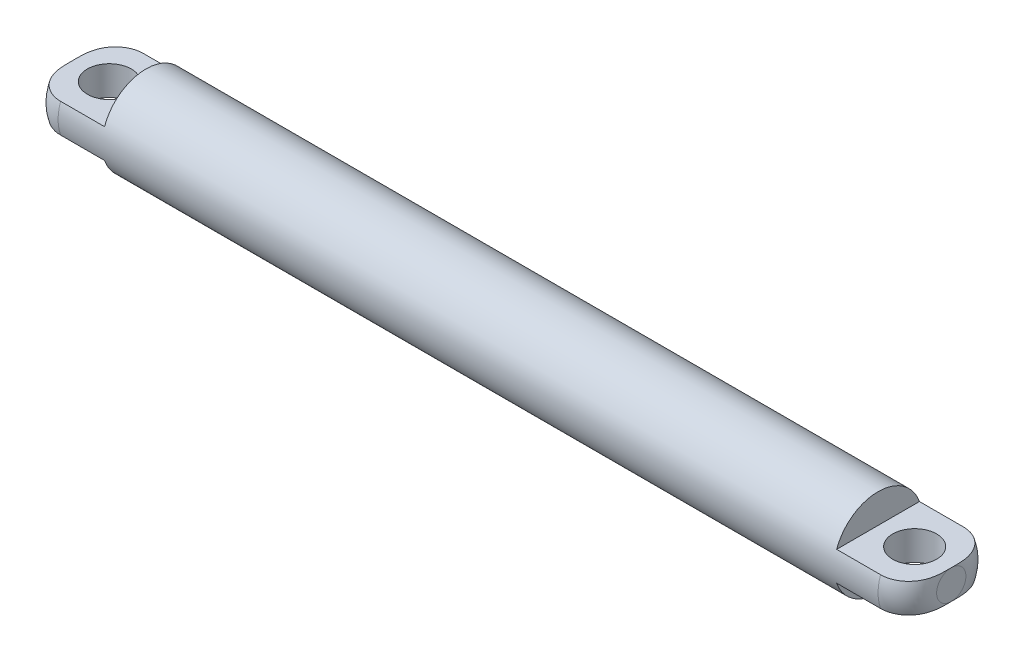
ISO-10303-21;
HEADER;
FILE_DESCRIPTION(('STEP AP214'),'2;1');
FILE_NAME('part.step','',(''),(''),'','','');
FILE_SCHEMA(('AUTOMOTIVE_DESIGN { 1 0 10303 214 1 1 1 1 }'));
ENDSEC;
DATA;
#1=APPLICATION_CONTEXT('core data for automotive mechanical design processes');
#2=APPLICATION_PROTOCOL_DEFINITION('international standard','automotive_design',2000,#1);
#3=PRODUCT_CONTEXT('',#1,'mechanical');
#4=PRODUCT('Part','Part','',(#3));
#5=PRODUCT_RELATED_PRODUCT_CATEGORY('part','',(#4));
#6=PRODUCT_DEFINITION_FORMATION('','',#4);
#7=PRODUCT_DEFINITION_CONTEXT('part definition',#1,'design');
#8=PRODUCT_DEFINITION('design','',#6,#7);
#9=PRODUCT_DEFINITION_SHAPE('','',#8);
#10=(LENGTH_UNIT() NAMED_UNIT(*) SI_UNIT(.MILLI.,.METRE.));
#11=(NAMED_UNIT(*) PLANE_ANGLE_UNIT() SI_UNIT($,.RADIAN.));
#12=(NAMED_UNIT(*) SI_UNIT($,.STERADIAN.) SOLID_ANGLE_UNIT());
#13=UNCERTAINTY_MEASURE_WITH_UNIT(LENGTH_MEASURE(1.E-05),#10,'distance_accuracy_value','');
#14=(GEOMETRIC_REPRESENTATION_CONTEXT(3) GLOBAL_UNCERTAINTY_ASSIGNED_CONTEXT((#13)) GLOBAL_UNIT_ASSIGNED_CONTEXT((#10,
#11,#12)) REPRESENTATION_CONTEXT('',''));
#15=CARTESIAN_POINT('',(0.,0.,0.));
#16=DIRECTION('',(0.,0.,1.));
#17=DIRECTION('',(1.,0.,0.));
#18=AXIS2_PLACEMENT_3D('',#15,#16,#17);
#19=CARTESIAN_POINT('',(30.,0.,0.));
#20=DIRECTION('',(-1.,0.,0.));
#21=DIRECTION('',(0.,0.,1.));
#22=AXIS2_PLACEMENT_3D('',#19,#20,#21);
#23=CYLINDRICAL_SURFACE('',#22,3.);
#24=DIRECTION('',(-1.,0.,0.));
#25=VECTOR('',#24,1.);
#26=CARTESIAN_POINT('',(30.,1.,-2.82842712474619));
#27=LINE('',#26,#25);
#28=CARTESIAN_POINT('',(28.,1.,-2.82842712474619));
#29=VERTEX_POINT('',#28);
#30=CARTESIAN_POINT('',(25.,1.,-2.82842712474619));
#31=VERTEX_POINT('',#30);
#32=EDGE_CURVE('E194',#29,#31,#27,.T.);
#33=ORIENTED_EDGE('',*,*,#32,.F.);
#34=CARTESIAN_POINT('',(28.,0.,0.));
#35=DIRECTION('',(-1.,0.,0.));
#36=DIRECTION('',(0.,-1.,0.));
#37=AXIS2_PLACEMENT_3D('',#34,#35,#36);
#38=CIRCLE('',#37,3.);
#39=CARTESIAN_POINT('',(28.,-1.,-2.82842712474619));
#40=VERTEX_POINT('',#39);
#41=EDGE_CURVE('E237',#29,#40,#38,.T.);
#42=ORIENTED_EDGE('',*,*,#41,.T.);
#43=DIRECTION('',(-1.,0.,0.));
#44=VECTOR('',#43,1.);
#45=CARTESIAN_POINT('',(30.,-1.,-2.82842712474619));
#46=LINE('',#45,#44);
#47=CARTESIAN_POINT('',(25.,-1.,-2.82842712474619));
#48=VERTEX_POINT('',#47);
#49=EDGE_CURVE('E188',#40,#48,#46,.T.);
#50=ORIENTED_EDGE('',*,*,#49,.T.);
#51=CARTESIAN_POINT('',(25.,0.,0.));
#52=DIRECTION('',(1.,0.,0.));
#53=DIRECTION('',(0.,1.,0.));
#54=AXIS2_PLACEMENT_3D('',#51,#52,#53);
#55=CIRCLE('',#54,3.);
#56=CARTESIAN_POINT('',(25.,-1.,2.82842712474619));
#57=VERTEX_POINT('',#56);
#58=EDGE_CURVE('E201',#48,#57,#55,.F.);
#59=ORIENTED_EDGE('',*,*,#58,.T.);
#60=DIRECTION('',(-1.,0.,0.));
#61=VECTOR('',#60,1.);
#62=CARTESIAN_POINT('',(30.,-1.,2.82842712474619));
#63=LINE('',#62,#61);
#64=CARTESIAN_POINT('',(28.,-1.,2.82842712474619));
#65=VERTEX_POINT('',#64);
#66=EDGE_CURVE('E187',#65,#57,#63,.T.);
#67=ORIENTED_EDGE('',*,*,#66,.F.);
#68=CARTESIAN_POINT('',(28.,0.,0.));
#69=DIRECTION('',(-1.,0.,0.));
#70=DIRECTION('',(0.,-1.,0.));
#71=AXIS2_PLACEMENT_3D('',#68,#69,#70);
#72=CIRCLE('',#71,3.);
#73=CARTESIAN_POINT('',(28.,1.,2.82842712474619));
#74=VERTEX_POINT('',#73);
#75=EDGE_CURVE('E204',#65,#74,#72,.T.);
#76=ORIENTED_EDGE('',*,*,#75,.T.);
#77=DIRECTION('',(-1.,0.,0.));
#78=VECTOR('',#77,1.);
#79=CARTESIAN_POINT('',(30.,1.,2.82842712474619));
#80=LINE('',#79,#78);
#81=CARTESIAN_POINT('',(25.,1.,2.82842712474619));
#82=VERTEX_POINT('',#81);
#83=EDGE_CURVE('E195',#74,#82,#80,.T.);
#84=ORIENTED_EDGE('',*,*,#83,.T.);
#85=CARTESIAN_POINT('',(25.,0.,0.));
#86=DIRECTION('',(1.,0.,0.));
#87=DIRECTION('',(0.,1.,0.));
#88=AXIS2_PLACEMENT_3D('',#85,#86,#87);
#89=CIRCLE('',#88,3.);
#90=EDGE_CURVE('E197',#82,#31,#89,.F.);
#91=ORIENTED_EDGE('',*,*,#90,.T.);
#92=EDGE_LOOP('',(#33,#42,#50,#59,#67,#76,#84,#91));
#93=FACE_BOUND('',#92,.T.);
#94=DIRECTION('',(-1.,0.,0.));
#95=VECTOR('',#94,1.);
#96=CARTESIAN_POINT('',(30.,-1.,-2.82842712474619));
#97=LINE('',#96,#95);
#98=CARTESIAN_POINT('',(-28.,-1.,-2.82842712474619));
#99=VERTEX_POINT('',#98);
#100=CARTESIAN_POINT('',(-25.,-1.,-2.82842712474619));
#101=VERTEX_POINT('',#100);
#102=EDGE_CURVE('E93',#99,#101,#97,.F.);
#103=ORIENTED_EDGE('',*,*,#102,.F.);
#104=CARTESIAN_POINT('',(-28.,0.,0.));
#105=DIRECTION('',(-1.,0.,0.));
#106=DIRECTION('',(0.,-1.,0.));
#107=AXIS2_PLACEMENT_3D('',#104,#105,#106);
#108=CIRCLE('',#107,3.);
#109=CARTESIAN_POINT('',(-28.,1.,-2.82842712474619));
#110=VERTEX_POINT('',#109);
#111=EDGE_CURVE('E28',#99,#110,#108,.F.);
#112=ORIENTED_EDGE('',*,*,#111,.T.);
#113=DIRECTION('',(-1.,0.,0.));
#114=VECTOR('',#113,1.);
#115=CARTESIAN_POINT('',(30.,1.,-2.82842712474619));
#116=LINE('',#115,#114);
#117=CARTESIAN_POINT('',(-25.,1.,-2.82842712474619));
#118=VERTEX_POINT('',#117);
#119=EDGE_CURVE('E171',#110,#118,#116,.F.);
#120=ORIENTED_EDGE('',*,*,#119,.T.);
#121=CARTESIAN_POINT('',(-25.,0.,0.));
#122=DIRECTION('',(-1.,0.,0.));
#123=DIRECTION('',(0.,-1.,0.));
#124=AXIS2_PLACEMENT_3D('',#121,#122,#123);
#125=CIRCLE('',#124,3.);
#126=CARTESIAN_POINT('',(-25.,1.,2.82842712474619));
#127=VERTEX_POINT('',#126);
#128=EDGE_CURVE('E108',#118,#127,#125,.F.);
#129=ORIENTED_EDGE('',*,*,#128,.T.);
#130=DIRECTION('',(-1.,0.,0.));
#131=VECTOR('',#130,1.);
#132=CARTESIAN_POINT('',(30.,1.,2.82842712474619));
#133=LINE('',#132,#131);
#134=CARTESIAN_POINT('',(-28.,1.,2.82842712474619));
#135=VERTEX_POINT('',#134);
#136=EDGE_CURVE('E168',#135,#127,#133,.F.);
#137=ORIENTED_EDGE('',*,*,#136,.F.);
#138=CARTESIAN_POINT('',(-28.,0.,0.));
#139=DIRECTION('',(-1.,0.,0.));
#140=DIRECTION('',(0.,-1.,0.));
#141=AXIS2_PLACEMENT_3D('',#138,#139,#140);
#142=CIRCLE('',#141,3.);
#143=CARTESIAN_POINT('',(-28.,-1.,2.82842712474619));
#144=VERTEX_POINT('',#143);
#145=EDGE_CURVE('E123',#135,#144,#142,.F.);
#146=ORIENTED_EDGE('',*,*,#145,.T.);
#147=DIRECTION('',(-1.,0.,0.));
#148=VECTOR('',#147,1.);
#149=CARTESIAN_POINT('',(30.,-1.,2.82842712474619));
#150=LINE('',#149,#148);
#151=CARTESIAN_POINT('',(-25.,-1.,2.82842712474619));
#152=VERTEX_POINT('',#151);
#153=EDGE_CURVE('E100',#144,#152,#150,.F.);
#154=ORIENTED_EDGE('',*,*,#153,.T.);
#155=CARTESIAN_POINT('',(-25.,0.,0.));
#156=DIRECTION('',(-1.,0.,0.));
#157=DIRECTION('',(0.,-1.,0.));
#158=AXIS2_PLACEMENT_3D('',#155,#156,#157);
#159=CIRCLE('',#158,3.);
#160=EDGE_CURVE('E104',#152,#101,#159,.F.);
#161=ORIENTED_EDGE('',*,*,#160,.T.);
#162=EDGE_LOOP('',(#103,#112,#120,#129,#137,#146,#154,#161));
#163=FACE_BOUND('',#162,.T.);
#164=ADVANCED_FACE('F16',(#93,#163),#23,.T.);
#165=CARTESIAN_POINT('',(-30.,0.,0.));
#166=DIRECTION('',(-1.,0.,0.));
#167=DIRECTION('',(0.,-1.,0.));
#168=AXIS2_PLACEMENT_3D('',#165,#166,#167);
#169=PLANE('',#168);
#170=CARTESIAN_POINT('',(-30.,0.,0.));
#171=DIRECTION('',(-1.,0.,0.));
#172=DIRECTION('',(0.,-1.,0.));
#173=AXIS2_PLACEMENT_3D('',#170,#171,#172);
#174=CIRCLE('',#173,1.);
#175=CARTESIAN_POINT('',(-30.,-1.,0.));
#176=VERTEX_POINT('',#175);
#177=CARTESIAN_POINT('',(-30.,1.,0.));
#178=VERTEX_POINT('',#177);
#179=EDGE_CURVE('E107',#176,#178,#174,.T.);
#180=ORIENTED_EDGE('',*,*,#179,.T.);
#181=CARTESIAN_POINT('',(-30.,0.,0.));
#182=DIRECTION('',(-1.,0.,0.));
#183=DIRECTION('',(0.,-1.,0.));
#184=AXIS2_PLACEMENT_3D('',#181,#182,#183);
#185=CIRCLE('',#184,1.);
#186=EDGE_CURVE('E145',#178,#176,#185,.T.);
#187=ORIENTED_EDGE('',*,*,#186,.T.);
#188=EDGE_LOOP('',(#180,#187));
#189=FACE_BOUND('',#188,.T.);
#190=ADVANCED_FACE('F158',(#189),#169,.T.);
#191=CARTESIAN_POINT('',(30.,0.,0.));
#192=DIRECTION('',(-1.,0.,0.));
#193=DIRECTION('',(0.,-1.,0.));
#194=AXIS2_PLACEMENT_3D('',#191,#192,#193);
#195=PLANE('',#194);
#196=CARTESIAN_POINT('',(30.,0.,0.));
#197=DIRECTION('',(-1.,0.,0.));
#198=DIRECTION('',(0.,-1.,0.));
#199=AXIS2_PLACEMENT_3D('',#196,#197,#198);
#200=CIRCLE('',#199,1.);
#201=CARTESIAN_POINT('',(30.,1.,0.));
#202=VERTEX_POINT('',#201);
#203=CARTESIAN_POINT('',(30.,-1.,0.));
#204=VERTEX_POINT('',#203);
#205=EDGE_CURVE('E215',#202,#204,#200,.F.);
#206=ORIENTED_EDGE('',*,*,#205,.T.);
#207=CARTESIAN_POINT('',(30.,0.,0.));
#208=DIRECTION('',(-1.,0.,0.));
#209=DIRECTION('',(0.,-1.,0.));
#210=AXIS2_PLACEMENT_3D('',#207,#208,#209);
#211=CIRCLE('',#210,1.);
#212=EDGE_CURVE('E251',#204,#202,#211,.F.);
#213=ORIENTED_EDGE('',*,*,#212,.T.);
#214=EDGE_LOOP('',(#206,#213));
#215=FACE_BOUND('',#214,.T.);
#216=ADVANCED_FACE('F273',(#215),#195,.F.);
#217=CARTESIAN_POINT('',(25.,1.,0.0674042553191455));
#218=DIRECTION('',(1.,0.,0.));
#219=DIRECTION('',(0.,1.,0.));
#220=AXIS2_PLACEMENT_3D('',#217,#218,#219);
#221=PLANE('',#220);
#222=DIRECTION('',(0.,0.,1.));
#223=VECTOR('',#222,1.);
#224=CARTESIAN_POINT('',(25.,1.,1.94246808510638));
#225=LINE('',#224,#223);
#226=EDGE_CURVE('E190',#31,#82,#225,.T.);
#227=ORIENTED_EDGE('',*,*,#226,.F.);
#228=ORIENTED_EDGE('',*,*,#90,.F.);
#229=EDGE_LOOP('',(#227,#228));
#230=FACE_BOUND('',#229,.T.);
#231=ADVANCED_FACE('F244',(#230),#221,.T.);
#232=CARTESIAN_POINT('',(25.,1.,1.94246808510638));
#233=DIRECTION('',(0.,1.,0.));
#234=DIRECTION('',(0.,0.,1.));
#235=AXIS2_PLACEMENT_3D('',#232,#233,#234);
#236=PLANE('',#235);
#237=CARTESIAN_POINT('',(27.5,1.,0.));
#238=DIRECTION('',(0.,1.,0.));
#239=DIRECTION('',(0.,0.,1.));
#240=AXIS2_PLACEMENT_3D('',#237,#238,#239);
#241=CIRCLE('',#240,1.5);
#242=CARTESIAN_POINT('',(27.5,1.,1.49999999999999));
#243=VERTEX_POINT('',#242);
#244=EDGE_CURVE('E181',#243,#243,#241,.T.);
#245=ORIENTED_EDGE('',*,*,#244,.F.);
#246=EDGE_LOOP('',(#245));
#247=FACE_BOUND('',#246,.T.);
#248=CARTESIAN_POINT('',(28.,1.,2.82842712474619));
#249=CARTESIAN_POINT('',(28.0534134185692,1.,2.82842727874098));
#250=CARTESIAN_POINT('',(28.1068009403029,1.,2.82615609057115));
#251=CARTESIAN_POINT('',(28.2131868748628,1.,2.81709913374379));
#252=CARTESIAN_POINT('',(28.2661853218281,1.,2.81031376608332));
#253=CARTESIAN_POINT('',(28.4237977959824,1.,2.78328069856728));
#254=CARTESIAN_POINT('',(28.527344962754,1.,2.75635563239891));
#255=CARTESIAN_POINT('',(28.7284247791076,1.,2.68552958072627));
#256=CARTESIAN_POINT('',(28.8259557756697,1.,2.6416239534729));
#257=CARTESIAN_POINT('',(29.0124262918775,1.,2.53818346737532));
#258=CARTESIAN_POINT('',(29.101360576554,1.,2.47863916636453));
#259=CARTESIAN_POINT('',(29.269129685692,1.,2.34510033639576));
#260=CARTESIAN_POINT('',(29.3478480525676,1.,2.27095997430665));
#261=CARTESIAN_POINT('',(29.4921296879379,1.,2.11103080172936));
#262=CARTESIAN_POINT('',(29.5577145845687,1.,2.02526153896786));
#263=CARTESIAN_POINT('',(29.6464926226104,1.,1.88819156070421));
#264=CARTESIAN_POINT('',(29.6748947452371,1.,1.84017291757007));
#265=CARTESIAN_POINT('',(29.727844841987,1.,1.74203010949198));
#266=CARTESIAN_POINT('',(29.7523919490601,1.,1.6919054740833));
#267=CARTESIAN_POINT('',(29.7977270069453,1.,1.58965856670973));
#268=CARTESIAN_POINT('',(29.8184932829791,1.,1.53752673205066));
#269=CARTESIAN_POINT('',(29.856156437881,1.,1.43192521666244));
#270=CARTESIAN_POINT('',(29.8730557370771,1.,1.37845639612616));
#271=CARTESIAN_POINT('',(29.9031414210198,1.,1.2705444246326));
#272=CARTESIAN_POINT('',(29.9163312285144,1.,1.21610222148526));
#273=CARTESIAN_POINT('',(29.9392740125722,1.,1.1064964336901));
#274=CARTESIAN_POINT('',(29.9490264116991,1.,1.05133272945287));
#275=CARTESIAN_POINT('',(29.9654864587239,1.,0.940347532108662));
#276=CARTESIAN_POINT('',(29.9721824192731,1.,0.88452433777076));
#277=CARTESIAN_POINT('',(29.9829638435405,1.,0.772638286801442));
#278=CARTESIAN_POINT('',(29.9870494473972,1.,0.716575443198437));
#279=CARTESIAN_POINT('',(29.9931672218253,1.,0.605248250162798));
#280=CARTESIAN_POINT('',(29.9952312996767,1.,0.549985527940671));
#281=CARTESIAN_POINT('',(29.9980725912754,1.,0.439425669261678));
#282=CARTESIAN_POINT('',(29.998849654657,1.,0.384128529538606));
#283=CARTESIAN_POINT('',(29.9997586713635,1.,0.274015164487416));
#284=CARTESIAN_POINT('',(29.9998962108802,1.,0.219198965595557));
#285=CARTESIAN_POINT('',(29.9999843379834,1.,0.136985611032237));
#286=CARTESIAN_POINT('',(29.999994026409,1.,0.109588396353902));
#287=CARTESIAN_POINT('',(30.000000288343,1.,0.0547941288638778));
#288=CARTESIAN_POINT('',(29.9999968619305,1.,0.0273970760522091));
#289=CARTESIAN_POINT('',(30.,1.,0.));
#290=B_SPLINE_CURVE_WITH_KNOTS('',3,(#248,#249,#250,#251,#252,#253,#254,#255,#256,#257,#258,
#259,#260,#261,#262,#263,#264,#265,#266,#267,#268,#269,#270,#271,#272,#273,#274,#275,#276,#277,
#278,#279,#280,#281,#282,#283,#284,#285,#286,#287,#288,#289),.UNSPECIFIED.,.F.,.F.,(4,2,2,2,2,2,
2,2,2,2,2,2,2,2,2,2,2,2,2,2,4),(0.,0.160140695968357,0.320267168449515,0.639584298722542,
0.958988778218193,1.27858654975606,1.60155633590395,1.92398980210736,2.09121351018164,
2.25847477564547,2.42666663721379,2.59475293834405,2.76268363356718,2.93064252535585,
3.09923839372392,3.2678252101614,3.43370602073401,3.59960621028102,3.7640545176238,
3.84624619393037,3.92843737385875),.UNSPECIFIED.);
#291=EDGE_CURVE('E207',#74,#202,#290,.T.);
#292=ORIENTED_EDGE('',*,*,#291,.T.);
#293=CARTESIAN_POINT('',(30.,1.,0.));
#294=CARTESIAN_POINT('',(29.9999811059462,1.,-0.0413051048091001));
#295=CARTESIAN_POINT('',(29.9999998714518,1.,-0.0826101738747882));
#296=CARTESIAN_POINT('',(29.999970879717,1.,-0.165222874211095));
#297=CARTESIAN_POINT('',(29.9999231182512,1.,-0.206530505477812));
#298=CARTESIAN_POINT('',(29.9996187489818,1.,-0.289267520785349));
#299=CARTESIAN_POINT('',(29.9993615257663,1.,-0.330696904674477));
#300=CARTESIAN_POINT('',(29.9983937565273,1.,-0.413550023625729));
#301=CARTESIAN_POINT('',(29.9976832090222,1.,-0.454973758668949));
#302=CARTESIAN_POINT('',(29.9944217496167,1.,-0.580658224593739));
#303=CARTESIAN_POINT('',(29.9907273831892,1.,-0.664900399595359));
#304=CARTESIAN_POINT('',(29.9780630817101,1.,-0.832932913292913));
#305=CARTESIAN_POINT('',(29.9690996333136,1.,-0.916723679932438));
#306=CARTESIAN_POINT('',(29.9468537643812,1.,-1.0653686350169));
#307=CARTESIAN_POINT('',(29.9349145798215,1.,-1.13042028696978));
#308=CARTESIAN_POINT('',(29.9061544146505,1.,-1.25945468255724));
#309=CARTESIAN_POINT('',(29.8893331953076,1.,-1.32343737375775));
#310=CARTESIAN_POINT('',(29.8505559373908,1.,-1.44942432107065));
#311=CARTESIAN_POINT('',(29.8286308943741,1.,-1.5114380489648));
#312=CARTESIAN_POINT('',(29.7794065494532,1.,-1.63332416258286));
#313=CARTESIAN_POINT('',(29.7521057812227,1.,-1.69319595877904));
#314=CARTESIAN_POINT('',(29.6917865874517,1.,-1.81080379539798));
#315=CARTESIAN_POINT('',(29.6587103394204,1.,-1.86851028196906));
#316=CARTESIAN_POINT('',(29.5871423138564,1.,-1.98050228012009));
#317=CARTESIAN_POINT('',(29.5486481746661,1.,-2.03478628481942));
#318=CARTESIAN_POINT('',(29.4664252187279,1.,-2.1393694448159));
#319=CARTESIAN_POINT('',(29.4226891789614,1.,-2.18966293919676));
#320=CARTESIAN_POINT('',(29.3303755276852,1.,-2.28559869601453));
#321=CARTESIAN_POINT('',(29.2817963433002,1.,-2.33123943761173));
#322=CARTESIAN_POINT('',(29.1438136001072,1.,-2.44814359903828));
#323=CARTESIAN_POINT('',(29.0500585975621,1.,-2.51439026871331));
#324=CARTESIAN_POINT('',(28.8524171570711,1.,-2.62905300420049));
#325=CARTESIAN_POINT('',(28.7485429807124,1.,-2.67749031820066));
#326=CARTESIAN_POINT('',(28.5386737135734,1.,-2.75316508721767));
#327=CARTESIAN_POINT('',(28.4329964558135,1.,-2.78127592056807));
#328=CARTESIAN_POINT('',(28.2720297631954,1.,-2.8095059630724));
#329=CARTESIAN_POINT('',(28.21788020628,1.,-2.81659339327167));
#330=CARTESIAN_POINT('',(28.1091628574479,1.,-2.82605444066287));
#331=CARTESIAN_POINT('',(28.0545950055283,1.,-2.82842736837363));
#332=CARTESIAN_POINT('',(28.,1.,-2.82842712474619));
#333=B_SPLINE_CURVE_WITH_KNOTS('',3,(#293,#294,#295,#296,#297,#298,#299,#300,#301,#302,#303,
#304,#305,#306,#307,#308,#309,#310,#311,#312,#313,#314,#315,#316,#317,#318,#319,#320,#321,#322,
#323,#324,#325,#326,#327,#328,#329,#330,#331,#332),.UNSPECIFIED.,.F.,.F.,(4,2,2,2,2,2,2,2,2,2,2,
2,2,2,2,2,2,2,2,4),(0.,0.123915213091161,0.247838297076798,0.372126794276857,0.496415697669469,
0.749287706863618,1.00184906071816,1.2000997872884,1.39836020995646,1.59544663712704,
1.79258689784029,1.99182769885301,2.19115561942924,2.39076142961193,2.59043227690346,
2.93288931892069,3.27493644229983,3.60123554224765,3.76489133262651,3.92857105538905),.UNSPECIFIED.);
#334=EDGE_CURVE('E114',#202,#29,#333,.T.);
#335=ORIENTED_EDGE('',*,*,#334,.T.);
#336=ORIENTED_EDGE('',*,*,#32,.T.);
#337=ORIENTED_EDGE('',*,*,#226,.T.);
#338=ORIENTED_EDGE('',*,*,#83,.F.);
#339=EDGE_LOOP('',(#292,#335,#336,#337,#338));
#340=FACE_BOUND('',#339,.T.);
#341=ADVANCED_FACE('F217',(#247,#340),#236,.T.);
#342=CARTESIAN_POINT('',(25.,-1.,0.0674042553191455));
#343=DIRECTION('',(1.,0.,0.));
#344=DIRECTION('',(0.,1.,0.));
#345=AXIS2_PLACEMENT_3D('',#342,#343,#344);
#346=PLANE('',#345);
#347=DIRECTION('',(0.,0.,-1.));
#348=VECTOR('',#347,1.);
#349=CARTESIAN_POINT('',(25.,-1.,-1.80765957446809));
#350=LINE('',#349,#348);
#351=EDGE_CURVE('E184',#57,#48,#350,.T.);
#352=ORIENTED_EDGE('',*,*,#351,.F.);
#353=ORIENTED_EDGE('',*,*,#58,.F.);
#354=EDGE_LOOP('',(#352,#353));
#355=FACE_BOUND('',#354,.T.);
#356=ADVANCED_FACE('F242',(#355),#346,.T.);
#357=CARTESIAN_POINT('',(25.,-1.,-1.80765957446809));
#358=DIRECTION('',(0.,-1.,0.));
#359=DIRECTION('',(0.,0.,-1.));
#360=AXIS2_PLACEMENT_3D('',#357,#358,#359);
#361=PLANE('',#360);
#362=CARTESIAN_POINT('',(27.5,-1.,0.));
#363=DIRECTION('',(0.,1.,0.));
#364=DIRECTION('',(0.,0.,-1.));
#365=AXIS2_PLACEMENT_3D('',#362,#363,#364);
#366=CIRCLE('',#365,1.5);
#367=CARTESIAN_POINT('',(27.5,-1.,-1.50000000000001));
#368=VERTEX_POINT('',#367);
#369=EDGE_CURVE('E174',#368,#368,#366,.T.);
#370=ORIENTED_EDGE('',*,*,#369,.T.);
#371=EDGE_LOOP('',(#370));
#372=FACE_BOUND('',#371,.T.);
#373=ORIENTED_EDGE('',*,*,#49,.F.);
#374=CARTESIAN_POINT('',(28.,-1.,-2.82842712474619));
#375=CARTESIAN_POINT('',(28.0534134185692,-1.,-2.82842727874098));
#376=CARTESIAN_POINT('',(28.1068009403029,-1.,-2.82615609057115));
#377=CARTESIAN_POINT('',(28.2131868748628,-1.,-2.8170991337438));
#378=CARTESIAN_POINT('',(28.2661853218281,-1.,-2.81031376608333));
#379=CARTESIAN_POINT('',(28.4237977959824,-1.,-2.78328069856728));
#380=CARTESIAN_POINT('',(28.527344962754,-1.,-2.75635563239892));
#381=CARTESIAN_POINT('',(28.7284247791076,-1.,-2.68552958072627));
#382=CARTESIAN_POINT('',(28.8259557756697,-1.,-2.6416239534729));
#383=CARTESIAN_POINT('',(29.0124262918775,-1.,-2.53818346737532));
#384=CARTESIAN_POINT('',(29.101360576554,-1.,-2.47863916636453));
#385=CARTESIAN_POINT('',(29.269129685692,-1.,-2.34510033639576));
#386=CARTESIAN_POINT('',(29.3478480525676,-1.,-2.27095997430665));
#387=CARTESIAN_POINT('',(29.4921296879379,-1.,-2.11103080172936));
#388=CARTESIAN_POINT('',(29.5577145845687,-1.,-2.02526153896786));
#389=CARTESIAN_POINT('',(29.6464926226104,-1.,-1.88819156070422));
#390=CARTESIAN_POINT('',(29.6748947452371,-1.,-1.84017291757007));
#391=CARTESIAN_POINT('',(29.727844841987,-1.,-1.74203010949199));
#392=CARTESIAN_POINT('',(29.7523919490601,-1.,-1.69190547408331));
#393=CARTESIAN_POINT('',(29.7977270069453,-1.,-1.58965856670973));
#394=CARTESIAN_POINT('',(29.8184932829791,-1.,-1.53752673205067));
#395=CARTESIAN_POINT('',(29.856156437881,-1.,-1.43192521666244));
#396=CARTESIAN_POINT('',(29.8730557370771,-1.,-1.37845639612616));
#397=CARTESIAN_POINT('',(29.9031414210198,-1.,-1.2705444246326));
#398=CARTESIAN_POINT('',(29.9163312285144,-1.,-1.21610222148526));
#399=CARTESIAN_POINT('',(29.9392740125722,-1.,-1.1064964336901));
#400=CARTESIAN_POINT('',(29.9490264116991,-1.,-1.05133272945288));
#401=CARTESIAN_POINT('',(29.9654864587239,-1.,-0.940347532108665));
#402=CARTESIAN_POINT('',(29.9721824192731,-1.,-0.884524337770764));
#403=CARTESIAN_POINT('',(29.9829638435405,-1.,-0.772638286801446));
#404=CARTESIAN_POINT('',(29.9870494473972,-1.,-0.716575443198441));
#405=CARTESIAN_POINT('',(29.9931672218253,-1.,-0.605248250162801));
#406=CARTESIAN_POINT('',(29.9952312996767,-1.,-0.549985527940674));
#407=CARTESIAN_POINT('',(29.9980725912754,-1.,-0.439425669261682));
#408=CARTESIAN_POINT('',(29.998849654657,-1.,-0.384128529538609));
#409=CARTESIAN_POINT('',(29.9997586713635,-1.,-0.274015164487419));
#410=CARTESIAN_POINT('',(29.9998962108802,-1.,-0.219198965595561));
#411=CARTESIAN_POINT('',(29.9999843379834,-1.,-0.13698561103224));
#412=CARTESIAN_POINT('',(29.999994026409,-1.,-0.109588396353906));
#413=CARTESIAN_POINT('',(30.000000288343,-1.,-0.0547941288638812));
#414=CARTESIAN_POINT('',(29.9999968619305,-1.,-0.0273970760522123));
#415=CARTESIAN_POINT('',(30.,-1.,0.));
#416=B_SPLINE_CURVE_WITH_KNOTS('',3,(#374,#375,#376,#377,#378,#379,#380,#381,#382,#383,#384,
#385,#386,#387,#388,#389,#390,#391,#392,#393,#394,#395,#396,#397,#398,#399,#400,#401,#402,#403,
#404,#405,#406,#407,#408,#409,#410,#411,#412,#413,#414,#415),.UNSPECIFIED.,.F.,.F.,(4,2,2,2,2,2,
2,2,2,2,2,2,2,2,2,2,2,2,2,2,4),(0.,0.160140695968357,0.320267168449515,0.639584298722542,
0.958988778218193,1.27858654975606,1.60155633590395,1.92398980210736,2.09121351018164,
2.25847477564547,2.42666663721378,2.59475293834405,2.76268363356718,2.93064252535585,
3.09923839372392,3.2678252101614,3.43370602073401,3.59960621028101,3.7640545176238,
3.84624619393037,3.92843737385875),.UNSPECIFIED.);
#417=EDGE_CURVE('E246',#40,#204,#416,.T.);
#418=ORIENTED_EDGE('',*,*,#417,.T.);
#419=CARTESIAN_POINT('',(30.,-1.,0.));
#420=CARTESIAN_POINT('',(29.9999811059462,-1.,0.0413051048090971));
#421=CARTESIAN_POINT('',(29.9999998714518,-1.,0.0826101738747852));
#422=CARTESIAN_POINT('',(29.999970879717,-1.,0.165222874211092));
#423=CARTESIAN_POINT('',(29.9999231182512,-1.,0.206530505477809));
#424=CARTESIAN_POINT('',(29.9996187489818,-1.,0.289267520785346));
#425=CARTESIAN_POINT('',(29.9993615257663,-1.,0.330696904674474));
#426=CARTESIAN_POINT('',(29.9983937565273,-1.,0.413550023625726));
#427=CARTESIAN_POINT('',(29.9976832090222,-1.,0.454973758668946));
#428=CARTESIAN_POINT('',(29.9944217496167,-1.,0.580658224593736));
#429=CARTESIAN_POINT('',(29.9907273831892,-1.,0.664900399595356));
#430=CARTESIAN_POINT('',(29.9780630817101,-1.,0.83293291329291));
#431=CARTESIAN_POINT('',(29.9690996333136,-1.,0.916723679932435));
#432=CARTESIAN_POINT('',(29.9468537643812,-1.,1.0653686350169));
#433=CARTESIAN_POINT('',(29.9349145798215,-1.,1.13042028696978));
#434=CARTESIAN_POINT('',(29.9061544146505,-1.,1.25945468255723));
#435=CARTESIAN_POINT('',(29.8893331953076,-1.,1.32343737375775));
#436=CARTESIAN_POINT('',(29.8505559373908,-1.,1.44942432107065));
#437=CARTESIAN_POINT('',(29.8286308943741,-1.,1.5114380489648));
#438=CARTESIAN_POINT('',(29.7794065494532,-1.,1.63332416258286));
#439=CARTESIAN_POINT('',(29.7521057812227,-1.,1.69319595877903));
#440=CARTESIAN_POINT('',(29.6917865874517,-1.,1.81080379539798));
#441=CARTESIAN_POINT('',(29.6587103394204,-1.,1.86851028196906));
#442=CARTESIAN_POINT('',(29.5871423138564,-1.,1.98050228012009));
#443=CARTESIAN_POINT('',(29.5486481746661,-1.,2.03478628481942));
#444=CARTESIAN_POINT('',(29.4664252187279,-1.,2.1393694448159));
#445=CARTESIAN_POINT('',(29.4226891789614,-1.,2.18966293919676));
#446=CARTESIAN_POINT('',(29.3303755276852,-1.,2.28559869601453));
#447=CARTESIAN_POINT('',(29.2817963433002,-1.,2.33123943761172));
#448=CARTESIAN_POINT('',(29.1438136001072,-1.,2.44814359903827));
#449=CARTESIAN_POINT('',(29.0500585975621,-1.,2.5143902687133));
#450=CARTESIAN_POINT('',(28.8524171570711,-1.,2.62905300420048));
#451=CARTESIAN_POINT('',(28.7485429807124,-1.,2.67749031820066));
#452=CARTESIAN_POINT('',(28.5386737135734,-1.,2.75316508721767));
#453=CARTESIAN_POINT('',(28.4329964558135,-1.,2.78127592056806));
#454=CARTESIAN_POINT('',(28.2720297631954,-1.,2.80950596307239));
#455=CARTESIAN_POINT('',(28.21788020628,-1.,2.81659339327167));
#456=CARTESIAN_POINT('',(28.109162857448,-1.,2.82605444066287));
#457=CARTESIAN_POINT('',(28.0545950055283,-1.,2.82842736837362));
#458=CARTESIAN_POINT('',(28.,-1.,2.82842712474619));
#459=B_SPLINE_CURVE_WITH_KNOTS('',3,(#419,#420,#421,#422,#423,#424,#425,#426,#427,#428,#429,
#430,#431,#432,#433,#434,#435,#436,#437,#438,#439,#440,#441,#442,#443,#444,#445,#446,#447,#448,
#449,#450,#451,#452,#453,#454,#455,#456,#457,#458),.UNSPECIFIED.,.F.,.F.,(4,2,2,2,2,2,2,2,2,2,2,
2,2,2,2,2,2,2,2,4),(0.,0.123915213091161,0.247838297076797,0.372126794276857,0.496415697669469,
0.749287706863617,1.00184906071816,1.2000997872884,1.39836020995646,1.59544663712704,
1.79258689784029,1.99182769885302,2.19115561942924,2.39076142961193,2.59043227690346,
2.93288931892069,3.27493644229983,3.60123554224765,3.76489133262651,3.92857105538905),.UNSPECIFIED.);
#460=EDGE_CURVE('E231',#204,#65,#459,.T.);
#461=ORIENTED_EDGE('',*,*,#460,.T.);
#462=ORIENTED_EDGE('',*,*,#66,.T.);
#463=ORIENTED_EDGE('',*,*,#351,.T.);
#464=EDGE_LOOP('',(#373,#418,#461,#462,#463));
#465=FACE_BOUND('',#464,.T.);
#466=ADVANCED_FACE('F239',(#372,#465),#361,.T.);
#467=CARTESIAN_POINT('',(27.5,-1.,0.));
#468=DIRECTION('',(0.,1.,0.));
#469=DIRECTION('',(0.,0.,-1.));
#470=AXIS2_PLACEMENT_3D('',#467,#468,#469);
#471=CYLINDRICAL_SURFACE('',#470,1.5);
#472=ORIENTED_EDGE('',*,*,#244,.T.);
#473=EDGE_LOOP('',(#472));
#474=FACE_BOUND('',#473,.T.);
#475=ORIENTED_EDGE('',*,*,#369,.F.);
#476=EDGE_LOOP('',(#475));
#477=FACE_BOUND('',#476,.T.);
#478=ADVANCED_FACE('F226',(#474,#477),#471,.F.);
#479=CARTESIAN_POINT('',(28.,0.,0.));
#480=DIRECTION('',(-1.,0.,0.));
#481=DIRECTION('',(0.,-1.,0.));
#482=AXIS2_PLACEMENT_3D('',#479,#480,#481);
#483=DEGENERATE_TOROIDAL_SURFACE('',#482,1.,2.,.T.);
#484=ORIENTED_EDGE('',*,*,#460,.F.);
#485=ORIENTED_EDGE('',*,*,#205,.F.);
#486=ORIENTED_EDGE('',*,*,#291,.F.);
#487=ORIENTED_EDGE('',*,*,#75,.F.);
#488=EDGE_LOOP('',(#484,#485,#486,#487));
#489=FACE_BOUND('',#488,.T.);
#490=ADVANCED_FACE('F221',(#489),#483,.T.);
#491=CARTESIAN_POINT('',(28.,0.,0.));
#492=DIRECTION('',(-1.,0.,0.));
#493=DIRECTION('',(0.,-1.,0.));
#494=AXIS2_PLACEMENT_3D('',#491,#492,#493);
#495=DEGENERATE_TOROIDAL_SURFACE('',#494,1.,2.,.T.);
#496=ORIENTED_EDGE('',*,*,#334,.F.);
#497=ORIENTED_EDGE('',*,*,#212,.F.);
#498=ORIENTED_EDGE('',*,*,#417,.F.);
#499=ORIENTED_EDGE('',*,*,#41,.F.);
#500=EDGE_LOOP('',(#496,#497,#498,#499));
#501=FACE_BOUND('',#500,.T.);
#502=ADVANCED_FACE('F225',(#501),#495,.T.);
#503=CARTESIAN_POINT('',(-25.,1.,0.0674042553191455));
#504=DIRECTION('',(-1.,0.,0.));
#505=DIRECTION('',(0.,-1.,0.));
#506=AXIS2_PLACEMENT_3D('',#503,#504,#505);
#507=PLANE('',#506);
#508=DIRECTION('',(0.,0.,-1.));
#509=VECTOR('',#508,1.);
#510=CARTESIAN_POINT('',(-25.,1.,-1.80765957446809));
#511=LINE('',#510,#509);
#512=EDGE_CURVE('E172',#127,#118,#511,.T.);
#513=ORIENTED_EDGE('',*,*,#512,.F.);
#514=ORIENTED_EDGE('',*,*,#128,.F.);
#515=EDGE_LOOP('',(#513,#514));
#516=FACE_BOUND('',#515,.T.);
#517=ADVANCED_FACE('F150',(#516),#507,.T.);
#518=CARTESIAN_POINT('',(-25.,1.,-1.80765957446809));
#519=DIRECTION('',(0.,1.,0.));
#520=DIRECTION('',(0.,0.,1.));
#521=AXIS2_PLACEMENT_3D('',#518,#519,#520);
#522=PLANE('',#521);
#523=CARTESIAN_POINT('',(-27.5,1.,0.));
#524=DIRECTION('',(0.,1.,0.));
#525=DIRECTION('',(0.,0.,1.));
#526=AXIS2_PLACEMENT_3D('',#523,#524,#525);
#527=CIRCLE('',#526,1.5);
#528=CARTESIAN_POINT('',(-27.5,1.,1.49999999999999));
#529=VERTEX_POINT('',#528);
#530=EDGE_CURVE('E105',#529,#529,#527,.T.);
#531=ORIENTED_EDGE('',*,*,#530,.F.);
#532=EDGE_LOOP('',(#531));
#533=FACE_BOUND('',#532,.T.);
#534=ORIENTED_EDGE('',*,*,#119,.F.);
#535=CARTESIAN_POINT('',(-28.,1.,-2.82842712474619));
#536=CARTESIAN_POINT('',(-28.0534134185692,1.,-2.82842727874098));
#537=CARTESIAN_POINT('',(-28.1068009403029,1.,-2.82615609057115));
#538=CARTESIAN_POINT('',(-28.2131868748628,1.,-2.8170991337438));
#539=CARTESIAN_POINT('',(-28.2661853218281,1.,-2.81031376608333));
#540=CARTESIAN_POINT('',(-28.4237977959824,1.,-2.78328069856729));
#541=CARTESIAN_POINT('',(-28.527344962754,1.,-2.75635563239892));
#542=CARTESIAN_POINT('',(-28.7284247791076,1.,-2.68552958072627));
#543=CARTESIAN_POINT('',(-28.8259557756697,1.,-2.6416239534729));
#544=CARTESIAN_POINT('',(-29.0124262918775,1.,-2.53818346737532));
#545=CARTESIAN_POINT('',(-29.101360576554,1.,-2.47863916636453));
#546=CARTESIAN_POINT('',(-29.269129685692,1.,-2.34510033639576));
#547=CARTESIAN_POINT('',(-29.3478480525676,1.,-2.27095997430665));
#548=CARTESIAN_POINT('',(-29.4921296879379,1.,-2.11103080172936));
#549=CARTESIAN_POINT('',(-29.5577145845687,1.,-2.02526153896786));
#550=CARTESIAN_POINT('',(-29.6464926226104,1.,-1.88819156070422));
#551=CARTESIAN_POINT('',(-29.6748947452371,1.,-1.84017291757007));
#552=CARTESIAN_POINT('',(-29.727844841987,1.,-1.74203010949199));
#553=CARTESIAN_POINT('',(-29.7523919490601,1.,-1.69190547408331));
#554=CARTESIAN_POINT('',(-29.7977270069453,1.,-1.58965856670973));
#555=CARTESIAN_POINT('',(-29.8184932829791,1.,-1.53752673205067));
#556=CARTESIAN_POINT('',(-29.856156437881,1.,-1.43192521666244));
#557=CARTESIAN_POINT('',(-29.8730557370771,1.,-1.37845639612616));
#558=CARTESIAN_POINT('',(-29.9031414210198,1.,-1.2705444246326));
#559=CARTESIAN_POINT('',(-29.9163312285144,1.,-1.21610222148526));
#560=CARTESIAN_POINT('',(-29.9392740125722,1.,-1.1064964336901));
#561=CARTESIAN_POINT('',(-29.9490264116991,1.,-1.05133272945288));
#562=CARTESIAN_POINT('',(-29.9654864587239,1.,-0.940347532108665));
#563=CARTESIAN_POINT('',(-29.9721824192731,1.,-0.884524337770764));
#564=CARTESIAN_POINT('',(-29.9829638435405,1.,-0.772638286801446));
#565=CARTESIAN_POINT('',(-29.9870494473972,1.,-0.716575443198441));
#566=CARTESIAN_POINT('',(-29.9931672218253,1.,-0.605248250162801));
#567=CARTESIAN_POINT('',(-29.9952312996767,1.,-0.549985527940674));
#568=CARTESIAN_POINT('',(-29.9980725912754,1.,-0.439425669261682));
#569=CARTESIAN_POINT('',(-29.998849654657,1.,-0.384128529538609));
#570=CARTESIAN_POINT('',(-29.9997586713635,1.,-0.274015164487419));
#571=CARTESIAN_POINT('',(-29.9998962108802,1.,-0.219198965595561));
#572=CARTESIAN_POINT('',(-29.9999843379834,1.,-0.13698561103224));
#573=CARTESIAN_POINT('',(-29.999994026409,1.,-0.109588396353906));
#574=CARTESIAN_POINT('',(-30.000000288343,1.,-0.0547941288638811));
#575=CARTESIAN_POINT('',(-29.9999968619305,1.,-0.0273970760522122));
#576=CARTESIAN_POINT('',(-30.,1.,0.));
#577=B_SPLINE_CURVE_WITH_KNOTS('',3,(#535,#536,#537,#538,#539,#540,#541,#542,#543,#544,#545,
#546,#547,#548,#549,#550,#551,#552,#553,#554,#555,#556,#557,#558,#559,#560,#561,#562,#563,#564,
#565,#566,#567,#568,#569,#570,#571,#572,#573,#574,#575,#576),.UNSPECIFIED.,.F.,.F.,(4,2,2,2,2,2,
2,2,2,2,2,2,2,2,2,2,2,2,2,2,4),(0.,0.160140695968357,0.320267168449515,0.639584298722542,
0.958988778218193,1.27858654975606,1.60155633590395,1.92398980210736,2.09121351018164,
2.25847477564547,2.42666663721378,2.59475293834405,2.76268363356718,2.93064252535585,
3.09923839372392,3.2678252101614,3.43370602073401,3.59960621028101,3.76405451762379,
3.84624619393037,3.92843737385875),.UNSPECIFIED.);
#578=EDGE_CURVE('E10',#110,#178,#577,.T.);
#579=ORIENTED_EDGE('',*,*,#578,.T.);
#580=CARTESIAN_POINT('',(-30.,1.,0.));
#581=CARTESIAN_POINT('',(-29.9999811059462,1.,0.0413051048090971));
#582=CARTESIAN_POINT('',(-29.9999998714518,1.,0.0826101738747852));
#583=CARTESIAN_POINT('',(-29.999970879717,1.,0.165222874211092));
#584=CARTESIAN_POINT('',(-29.9999231182512,1.,0.206530505477809));
#585=CARTESIAN_POINT('',(-29.9996187489818,1.,0.289267520785346));
#586=CARTESIAN_POINT('',(-29.9993615257663,1.,0.330696904674474));
#587=CARTESIAN_POINT('',(-29.9983937565273,1.,0.413550023625726));
#588=CARTESIAN_POINT('',(-29.9976832090222,1.,0.454973758668946));
#589=CARTESIAN_POINT('',(-29.9944217496167,1.,0.580658224593736));
#590=CARTESIAN_POINT('',(-29.9907273831892,1.,0.664900399595356));
#591=CARTESIAN_POINT('',(-29.9780630817101,1.,0.83293291329291));
#592=CARTESIAN_POINT('',(-29.9690996333136,1.,0.916723679932435));
#593=CARTESIAN_POINT('',(-29.9468537643812,1.,1.0653686350169));
#594=CARTESIAN_POINT('',(-29.9349145798215,1.,1.13042028696978));
#595=CARTESIAN_POINT('',(-29.9061544146505,1.,1.25945468255723));
#596=CARTESIAN_POINT('',(-29.8893331953076,1.,1.32343737375775));
#597=CARTESIAN_POINT('',(-29.8505559373908,1.,1.44942432107065));
#598=CARTESIAN_POINT('',(-29.8286308943741,1.,1.5114380489648));
#599=CARTESIAN_POINT('',(-29.7794065494532,1.,1.63332416258286));
#600=CARTESIAN_POINT('',(-29.7521057812227,1.,1.69319595877903));
#601=CARTESIAN_POINT('',(-29.6917865874517,1.,1.81080379539798));
#602=CARTESIAN_POINT('',(-29.6587103394204,1.,1.86851028196906));
#603=CARTESIAN_POINT('',(-29.5871423138564,1.,1.98050228012009));
#604=CARTESIAN_POINT('',(-29.5486481746661,1.,2.03478628481942));
#605=CARTESIAN_POINT('',(-29.4664252187279,1.,2.1393694448159));
#606=CARTESIAN_POINT('',(-29.4226891789614,1.,2.18966293919676));
#607=CARTESIAN_POINT('',(-29.3303755276852,1.,2.28559869601453));
#608=CARTESIAN_POINT('',(-29.2817963433002,1.,2.33123943761172));
#609=CARTESIAN_POINT('',(-29.1438136001072,1.,2.44814359903827));
#610=CARTESIAN_POINT('',(-29.0500585975621,1.,2.5143902687133));
#611=CARTESIAN_POINT('',(-28.8524171570711,1.,2.62905300420048));
#612=CARTESIAN_POINT('',(-28.7485429807124,1.,2.67749031820066));
#613=CARTESIAN_POINT('',(-28.5386737135734,1.,2.75316508721767));
#614=CARTESIAN_POINT('',(-28.4329964558135,1.,2.78127592056806));
#615=CARTESIAN_POINT('',(-28.2720297631954,1.,2.80950596307239));
#616=CARTESIAN_POINT('',(-28.21788020628,1.,2.81659339327167));
#617=CARTESIAN_POINT('',(-28.109162857448,1.,2.82605444066287));
#618=CARTESIAN_POINT('',(-28.0545950055283,1.,2.82842736837362));
#619=CARTESIAN_POINT('',(-28.,1.,2.82842712474619));
#620=B_SPLINE_CURVE_WITH_KNOTS('',3,(#580,#581,#582,#583,#584,#585,#586,#587,#588,#589,#590,
#591,#592,#593,#594,#595,#596,#597,#598,#599,#600,#601,#602,#603,#604,#605,#606,#607,#608,#609,
#610,#611,#612,#613,#614,#615,#616,#617,#618,#619),.UNSPECIFIED.,.F.,.F.,(4,2,2,2,2,2,2,2,2,2,2,
2,2,2,2,2,2,2,2,4),(0.,0.123915213091161,0.247838297076797,0.372126794276857,0.496415697669469,
0.749287706863617,1.00184906071816,1.2000997872884,1.39836020995646,1.59544663712704,
1.79258689784029,1.99182769885302,2.19115561942924,2.39076142961193,2.59043227690346,
2.93288931892069,3.27493644229983,3.60123554224765,3.76489133262651,3.92857105538905),.UNSPECIFIED.);
#621=EDGE_CURVE('E111',#178,#135,#620,.T.);
#622=ORIENTED_EDGE('',*,*,#621,.T.);
#623=ORIENTED_EDGE('',*,*,#136,.T.);
#624=ORIENTED_EDGE('',*,*,#512,.T.);
#625=EDGE_LOOP('',(#534,#579,#622,#623,#624));
#626=FACE_BOUND('',#625,.T.);
#627=ADVANCED_FACE('F125',(#533,#626),#522,.T.);
#628=CARTESIAN_POINT('',(-25.,-1.,0.0674042553191455));
#629=DIRECTION('',(-1.,0.,0.));
#630=DIRECTION('',(0.,-1.,0.));
#631=AXIS2_PLACEMENT_3D('',#628,#629,#630);
#632=PLANE('',#631);
#633=DIRECTION('',(0.,0.,1.));
#634=VECTOR('',#633,1.);
#635=CARTESIAN_POINT('',(-25.,-1.,1.94246808510638));
#636=LINE('',#635,#634);
#637=EDGE_CURVE('E97',#101,#152,#636,.T.);
#638=ORIENTED_EDGE('',*,*,#637,.F.);
#639=ORIENTED_EDGE('',*,*,#160,.F.);
#640=EDGE_LOOP('',(#638,#639));
#641=FACE_BOUND('',#640,.T.);
#642=ADVANCED_FACE('F103',(#641),#632,.T.);
#643=CARTESIAN_POINT('',(-25.,-1.,1.94246808510638));
#644=DIRECTION('',(0.,-1.,0.));
#645=DIRECTION('',(0.,0.,-1.));
#646=AXIS2_PLACEMENT_3D('',#643,#644,#645);
#647=PLANE('',#646);
#648=CARTESIAN_POINT('',(-27.5,-1.,0.));
#649=DIRECTION('',(0.,1.,0.));
#650=DIRECTION('',(0.,0.,-1.));
#651=AXIS2_PLACEMENT_3D('',#648,#649,#650);
#652=CIRCLE('',#651,1.5);
#653=CARTESIAN_POINT('',(-27.5,-1.,-1.50000000000001));
#654=VERTEX_POINT('',#653);
#655=EDGE_CURVE('E496',#654,#654,#652,.T.);
#656=ORIENTED_EDGE('',*,*,#655,.T.);
#657=EDGE_LOOP('',(#656));
#658=FACE_BOUND('',#657,.T.);
#659=CARTESIAN_POINT('',(-28.,-1.,2.82842712474619));
#660=CARTESIAN_POINT('',(-28.0534134185692,-1.,2.82842727874098));
#661=CARTESIAN_POINT('',(-28.1068009403029,-1.,2.82615609057115));
#662=CARTESIAN_POINT('',(-28.2131868748628,-1.,2.8170991337438));
#663=CARTESIAN_POINT('',(-28.2661853218281,-1.,2.81031376608332));
#664=CARTESIAN_POINT('',(-28.4237977959824,-1.,2.78328069856728));
#665=CARTESIAN_POINT('',(-28.527344962754,-1.,2.75635563239891));
#666=CARTESIAN_POINT('',(-28.7284247791076,-1.,2.68552958072627));
#667=CARTESIAN_POINT('',(-28.8259557756697,-1.,2.6416239534729));
#668=CARTESIAN_POINT('',(-29.0124262918775,-1.,2.53818346737532));
#669=CARTESIAN_POINT('',(-29.101360576554,-1.,2.47863916636453));
#670=CARTESIAN_POINT('',(-29.269129685692,-1.,2.34510033639576));
#671=CARTESIAN_POINT('',(-29.3478480525676,-1.,2.27095997430665));
#672=CARTESIAN_POINT('',(-29.4921296879379,-1.,2.11103080172936));
#673=CARTESIAN_POINT('',(-29.5577145845687,-1.,2.02526153896786));
#674=CARTESIAN_POINT('',(-29.6464926226104,-1.,1.88819156070421));
#675=CARTESIAN_POINT('',(-29.6748947452371,-1.,1.84017291757007));
#676=CARTESIAN_POINT('',(-29.7278448419871,-1.,1.74203010949198));
#677=CARTESIAN_POINT('',(-29.7523919490601,-1.,1.6919054740833));
#678=CARTESIAN_POINT('',(-29.7977270069453,-1.,1.58965856670973));
#679=CARTESIAN_POINT('',(-29.8184932829791,-1.,1.53752673205066));
#680=CARTESIAN_POINT('',(-29.856156437881,-1.,1.43192521666244));
#681=CARTESIAN_POINT('',(-29.8730557370771,-1.,1.37845639612616));
#682=CARTESIAN_POINT('',(-29.9031414210198,-1.,1.2705444246326));
#683=CARTESIAN_POINT('',(-29.9163312285144,-1.,1.21610222148526));
#684=CARTESIAN_POINT('',(-29.9392740125722,-1.,1.1064964336901));
#685=CARTESIAN_POINT('',(-29.9490264116991,-1.,1.05133272945287));
#686=CARTESIAN_POINT('',(-29.9654864587239,-1.,0.940347532108662));
#687=CARTESIAN_POINT('',(-29.9721824192731,-1.,0.884524337770761));
#688=CARTESIAN_POINT('',(-29.9829638435405,-1.,0.772638286801443));
#689=CARTESIAN_POINT('',(-29.9870494473972,-1.,0.716575443198438));
#690=CARTESIAN_POINT('',(-29.9931672218253,-1.,0.605248250162798));
#691=CARTESIAN_POINT('',(-29.9952312996767,-1.,0.549985527940671));
#692=CARTESIAN_POINT('',(-29.9980725912754,-1.,0.439425669261678));
#693=CARTESIAN_POINT('',(-29.998849654657,-1.,0.384128529538606));
#694=CARTESIAN_POINT('',(-29.9997586713635,-1.,0.274015164487416));
#695=CARTESIAN_POINT('',(-29.9998962108802,-1.,0.219198965595558));
#696=CARTESIAN_POINT('',(-29.9999843379834,-1.,0.136985611032237));
#697=CARTESIAN_POINT('',(-29.999994026409,-1.,0.109588396353903));
#698=CARTESIAN_POINT('',(-30.000000288343,-1.,0.054794128863878));
#699=CARTESIAN_POINT('',(-29.9999968619305,-1.,0.0273970760522092));
#700=CARTESIAN_POINT('',(-30.,-1.,0.));
#701=B_SPLINE_CURVE_WITH_KNOTS('',3,(#659,#660,#661,#662,#663,#664,#665,#666,#667,#668,#669,
#670,#671,#672,#673,#674,#675,#676,#677,#678,#679,#680,#681,#682,#683,#684,#685,#686,#687,#688,
#689,#690,#691,#692,#693,#694,#695,#696,#697,#698,#699,#700),.UNSPECIFIED.,.F.,.F.,(4,2,2,2,2,2,
2,2,2,2,2,2,2,2,2,2,2,2,2,2,4),(0.,0.160140695968357,0.320267168449515,0.639584298722542,
0.958988778218193,1.27858654975606,1.60155633590395,1.92398980210736,2.09121351018165,
2.25847477564547,2.42666663721378,2.59475293834405,2.76268363356718,2.93064252535585,
3.09923839372392,3.2678252101614,3.43370602073401,3.59960621028101,3.7640545176238,
3.84624619393037,3.92843737385875),.UNSPECIFIED.);
#702=EDGE_CURVE('E139',#144,#176,#701,.T.);
#703=ORIENTED_EDGE('',*,*,#702,.T.);
#704=CARTESIAN_POINT('',(-30.,-1.,0.));
#705=CARTESIAN_POINT('',(-29.9999811059462,-1.,-0.0413051048091001));
#706=CARTESIAN_POINT('',(-29.9999998714518,-1.,-0.0826101738747882));
#707=CARTESIAN_POINT('',(-29.999970879717,-1.,-0.165222874211095));
#708=CARTESIAN_POINT('',(-29.9999231182512,-1.,-0.206530505477812));
#709=CARTESIAN_POINT('',(-29.9996187489818,-1.,-0.289267520785349));
#710=CARTESIAN_POINT('',(-29.9993615257663,-1.,-0.330696904674477));
#711=CARTESIAN_POINT('',(-29.9983937565273,-1.,-0.413550023625729));
#712=CARTESIAN_POINT('',(-29.9976832090222,-1.,-0.454973758668949));
#713=CARTESIAN_POINT('',(-29.9944217496167,-1.,-0.580658224593739));
#714=CARTESIAN_POINT('',(-29.9907273831892,-1.,-0.664900399595359));
#715=CARTESIAN_POINT('',(-29.9780630817101,-1.,-0.832932913292913));
#716=CARTESIAN_POINT('',(-29.9690996333136,-1.,-0.916723679932438));
#717=CARTESIAN_POINT('',(-29.9468537643812,-1.,-1.0653686350169));
#718=CARTESIAN_POINT('',(-29.9349145798215,-1.,-1.13042028696978));
#719=CARTESIAN_POINT('',(-29.9061544146505,-1.,-1.25945468255724));
#720=CARTESIAN_POINT('',(-29.8893331953076,-1.,-1.32343737375775));
#721=CARTESIAN_POINT('',(-29.8505559373908,-1.,-1.44942432107065));
#722=CARTESIAN_POINT('',(-29.8286308943741,-1.,-1.5114380489648));
#723=CARTESIAN_POINT('',(-29.7794065494532,-1.,-1.63332416258286));
#724=CARTESIAN_POINT('',(-29.7521057812227,-1.,-1.69319595877904));
#725=CARTESIAN_POINT('',(-29.6917865874517,-1.,-1.81080379539798));
#726=CARTESIAN_POINT('',(-29.6587103394204,-1.,-1.86851028196906));
#727=CARTESIAN_POINT('',(-29.5871423138564,-1.,-1.98050228012009));
#728=CARTESIAN_POINT('',(-29.5486481746661,-1.,-2.03478628481942));
#729=CARTESIAN_POINT('',(-29.4664252187279,-1.,-2.1393694448159));
#730=CARTESIAN_POINT('',(-29.4226891789614,-1.,-2.18966293919676));
#731=CARTESIAN_POINT('',(-29.3303755276852,-1.,-2.28559869601453));
#732=CARTESIAN_POINT('',(-29.2817963433002,-1.,-2.33123943761173));
#733=CARTESIAN_POINT('',(-29.1438136001072,-1.,-2.44814359903828));
#734=CARTESIAN_POINT('',(-29.0500585975621,-1.,-2.51439026871331));
#735=CARTESIAN_POINT('',(-28.8524171570711,-1.,-2.62905300420049));
#736=CARTESIAN_POINT('',(-28.7485429807124,-1.,-2.67749031820066));
#737=CARTESIAN_POINT('',(-28.5386737135734,-1.,-2.75316508721767));
#738=CARTESIAN_POINT('',(-28.4329964558135,-1.,-2.78127592056807));
#739=CARTESIAN_POINT('',(-28.2720297631954,-1.,-2.8095059630724));
#740=CARTESIAN_POINT('',(-28.21788020628,-1.,-2.81659339327167));
#741=CARTESIAN_POINT('',(-28.1091628574479,-1.,-2.82605444066287));
#742=CARTESIAN_POINT('',(-28.0545950055283,-1.,-2.82842736837363));
#743=CARTESIAN_POINT('',(-28.,-1.,-2.82842712474619));
#744=B_SPLINE_CURVE_WITH_KNOTS('',3,(#704,#705,#706,#707,#708,#709,#710,#711,#712,#713,#714,
#715,#716,#717,#718,#719,#720,#721,#722,#723,#724,#725,#726,#727,#728,#729,#730,#731,#732,#733,
#734,#735,#736,#737,#738,#739,#740,#741,#742,#743),.UNSPECIFIED.,.F.,.F.,(4,2,2,2,2,2,2,2,2,2,2,
2,2,2,2,2,2,2,2,4),(0.,0.123915213091161,0.247838297076798,0.372126794276857,0.496415697669469,
0.749287706863618,1.00184906071816,1.2000997872884,1.39836020995646,1.59544663712704,
1.79258689784029,1.99182769885301,2.19115561942924,2.39076142961193,2.59043227690346,
2.93288931892069,3.27493644229983,3.60123554224765,3.76489133262651,3.92857105538905),.UNSPECIFIED.);
#745=EDGE_CURVE('E42',#176,#99,#744,.T.);
#746=ORIENTED_EDGE('',*,*,#745,.T.);
#747=ORIENTED_EDGE('',*,*,#102,.T.);
#748=ORIENTED_EDGE('',*,*,#637,.T.);
#749=ORIENTED_EDGE('',*,*,#153,.F.);
#750=EDGE_LOOP('',(#703,#746,#747,#748,#749));
#751=FACE_BOUND('',#750,.T.);
#752=ADVANCED_FACE('F95',(#658,#751),#647,.T.);
#753=CARTESIAN_POINT('',(-27.5,-1.,0.));
#754=DIRECTION('',(0.,1.,0.));
#755=DIRECTION('',(0.,0.,-1.));
#756=AXIS2_PLACEMENT_3D('',#753,#754,#755);
#757=CYLINDRICAL_SURFACE('',#756,1.5);
#758=ORIENTED_EDGE('',*,*,#530,.T.);
#759=EDGE_LOOP('',(#758));
#760=FACE_BOUND('',#759,.T.);
#761=ORIENTED_EDGE('',*,*,#655,.F.);
#762=EDGE_LOOP('',(#761));
#763=FACE_BOUND('',#762,.T.);
#764=ADVANCED_FACE('F134',(#760,#763),#757,.F.);
#765=CARTESIAN_POINT('',(-28.,0.,0.));
#766=DIRECTION('',(-1.,0.,0.));
#767=DIRECTION('',(0.,-1.,0.));
#768=AXIS2_PLACEMENT_3D('',#765,#766,#767);
#769=DEGENERATE_TOROIDAL_SURFACE('',#768,1.,2.,.T.);
#770=ORIENTED_EDGE('',*,*,#702,.F.);
#771=ORIENTED_EDGE('',*,*,#145,.F.);
#772=ORIENTED_EDGE('',*,*,#621,.F.);
#773=ORIENTED_EDGE('',*,*,#179,.F.);
#774=EDGE_LOOP('',(#770,#771,#772,#773));
#775=FACE_BOUND('',#774,.T.);
#776=ADVANCED_FACE('F129',(#775),#769,.T.);
#777=CARTESIAN_POINT('',(-28.,0.,0.));
#778=DIRECTION('',(-1.,0.,0.));
#779=DIRECTION('',(0.,-1.,0.));
#780=AXIS2_PLACEMENT_3D('',#777,#778,#779);
#781=DEGENERATE_TOROIDAL_SURFACE('',#780,1.,2.,.T.);
#782=ORIENTED_EDGE('',*,*,#578,.F.);
#783=ORIENTED_EDGE('',*,*,#111,.F.);
#784=ORIENTED_EDGE('',*,*,#745,.F.);
#785=ORIENTED_EDGE('',*,*,#186,.F.);
#786=EDGE_LOOP('',(#782,#783,#784,#785));
#787=FACE_BOUND('',#786,.T.);
#788=ADVANCED_FACE('F133',(#787),#781,.T.);
#789=CLOSED_SHELL('',(#164,#190,#216,#231,#341,#356,#466,#478,#490,#502,#517,#627,#642,#752,
#764,#776,#788));
#790=MANIFOLD_SOLID_BREP('B1',#789);
#791=ADVANCED_BREP_SHAPE_REPRESENTATION('',(#18,#790),#14);
#792=SHAPE_DEFINITION_REPRESENTATION(#9,#791);
ENDSEC;
END-ISO-10303-21;
